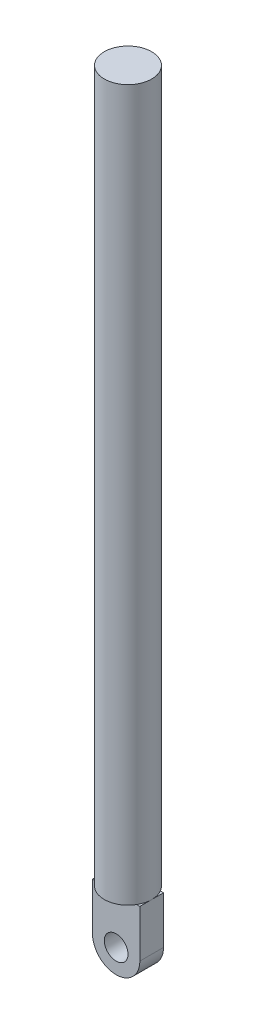
ISO-10303-21;
HEADER;
FILE_DESCRIPTION(('STEP AP214'),'2;1');
FILE_NAME('part.step','',(''),(''),'','','');
FILE_SCHEMA(('AUTOMOTIVE_DESIGN { 1 0 10303 214 1 1 1 1 }'));
ENDSEC;
DATA;
#1=APPLICATION_CONTEXT('core data for automotive mechanical design processes');
#2=APPLICATION_PROTOCOL_DEFINITION('international standard','automotive_design',2000,#1);
#3=PRODUCT_CONTEXT('',#1,'mechanical');
#4=PRODUCT('Part','Part','',(#3));
#5=PRODUCT_RELATED_PRODUCT_CATEGORY('part','',(#4));
#6=PRODUCT_DEFINITION_FORMATION('','',#4);
#7=PRODUCT_DEFINITION_CONTEXT('part definition',#1,'design');
#8=PRODUCT_DEFINITION('design','',#6,#7);
#9=PRODUCT_DEFINITION_SHAPE('','',#8);
#10=(LENGTH_UNIT() NAMED_UNIT(*) SI_UNIT(.MILLI.,.METRE.));
#11=(NAMED_UNIT(*) PLANE_ANGLE_UNIT() SI_UNIT($,.RADIAN.));
#12=(NAMED_UNIT(*) SI_UNIT($,.STERADIAN.) SOLID_ANGLE_UNIT());
#13=UNCERTAINTY_MEASURE_WITH_UNIT(LENGTH_MEASURE(1.E-05),#10,'distance_accuracy_value','');
#14=(GEOMETRIC_REPRESENTATION_CONTEXT(3) GLOBAL_UNCERTAINTY_ASSIGNED_CONTEXT((#13)) GLOBAL_UNIT_ASSIGNED_CONTEXT((#10,
#11,#12)) REPRESENTATION_CONTEXT('',''));
#15=CARTESIAN_POINT('',(0.,0.,0.));
#16=DIRECTION('',(0.,0.,1.));
#17=DIRECTION('',(1.,0.,0.));
#18=AXIS2_PLACEMENT_3D('',#15,#16,#17);
#19=CARTESIAN_POINT('',(0.,190.5,0.));
#20=DIRECTION('',(0.,-1.,0.));
#21=DIRECTION('',(0.,0.,-1.));
#22=AXIS2_PLACEMENT_3D('',#19,#20,#21);
#23=CYLINDRICAL_SURFACE('',#22,12.7);
#24=CARTESIAN_POINT('',(0.,190.5,0.));
#25=DIRECTION('',(0.,1.,0.));
#26=DIRECTION('',(0.,0.,1.));
#27=AXIS2_PLACEMENT_3D('',#24,#25,#26);
#28=CIRCLE('',#27,12.7);
#29=CARTESIAN_POINT('',(0.,190.5,12.7));
#30=VERTEX_POINT('',#29);
#31=EDGE_CURVE('E206',#30,#30,#28,.T.);
#32=ORIENTED_EDGE('',*,*,#31,.F.);
#33=EDGE_LOOP('',(#32));
#34=FACE_BOUND('',#33,.T.);
#35=CARTESIAN_POINT('',(0.,-190.5,0.));
#36=DIRECTION('',(0.,1.,0.));
#37=DIRECTION('',(0.,0.,1.));
#38=AXIS2_PLACEMENT_3D('',#35,#36,#37);
#39=CIRCLE('',#38,12.7);
#40=CARTESIAN_POINT('',(-10.9985226280624,-190.5,6.34999999999998));
#41=VERTEX_POINT('',#40);
#42=CARTESIAN_POINT('',(10.9985226280624,-190.5,6.34999999999998));
#43=VERTEX_POINT('',#42);
#44=EDGE_CURVE('E210',#41,#43,#39,.T.);
#45=ORIENTED_EDGE('',*,*,#44,.T.);
#46=CARTESIAN_POINT('',(12.7,-190.5,0.));
#47=VERTEX_POINT('',#46);
#48=EDGE_CURVE('E188',#43,#47,#39,.T.);
#49=ORIENTED_EDGE('',*,*,#48,.T.);
#50=CARTESIAN_POINT('',(10.9985226280623,-190.5,-6.35000000000002));
#51=VERTEX_POINT('',#50);
#52=EDGE_CURVE('E212',#47,#51,#39,.T.);
#53=ORIENTED_EDGE('',*,*,#52,.T.);
#54=CARTESIAN_POINT('',(-10.9985226280624,-190.5,-6.35000000000002));
#55=VERTEX_POINT('',#54);
#56=EDGE_CURVE('E634',#51,#55,#39,.T.);
#57=ORIENTED_EDGE('',*,*,#56,.T.);
#58=CARTESIAN_POINT('',(-12.7,-190.5,0.));
#59=VERTEX_POINT('',#58);
#60=EDGE_CURVE('E635',#55,#59,#39,.T.);
#61=ORIENTED_EDGE('',*,*,#60,.T.);
#62=EDGE_CURVE('E201',#59,#41,#39,.T.);
#63=ORIENTED_EDGE('',*,*,#62,.T.);
#64=EDGE_LOOP('',(#45,#49,#53,#57,#61,#63));
#65=FACE_BOUND('',#64,.T.);
#66=ADVANCED_FACE('F31',(#34,#65),#23,.T.);
#67=CARTESIAN_POINT('',(0.,190.5,0.));
#68=DIRECTION('',(0.,1.,0.));
#69=DIRECTION('',(0.,0.,1.));
#70=AXIS2_PLACEMENT_3D('',#67,#68,#69);
#71=PLANE('',#70);
#72=ORIENTED_EDGE('',*,*,#31,.T.);
#73=EDGE_LOOP('',(#72));
#74=FACE_BOUND('',#73,.T.);
#75=ADVANCED_FACE('F587',(#74),#71,.T.);
#76=CARTESIAN_POINT('',(-12.7,-190.5,12.7));
#77=DIRECTION('',(0.,1.,0.));
#78=DIRECTION('',(0.,0.,1.));
#79=AXIS2_PLACEMENT_3D('',#76,#77,#78);
#80=PLANE('',#79);
#81=DIRECTION('',(1.,0.,0.));
#82=VECTOR('',#81,1.);
#83=CARTESIAN_POINT('',(-61.0429684205974,-190.5,6.34999999999998));
#84=LINE('',#83,#82);
#85=CARTESIAN_POINT('',(12.7,-190.5,6.34999999999998));
#86=VERTEX_POINT('',#85);
#87=EDGE_CURVE('E173',#43,#86,#84,.T.);
#88=ORIENTED_EDGE('',*,*,#87,.T.);
#89=DIRECTION('',(0.,0.,1.));
#90=VECTOR('',#89,1.);
#91=CARTESIAN_POINT('',(12.7,-190.5,-12.7));
#92=LINE('',#91,#90);
#93=EDGE_CURVE('E187',#47,#86,#92,.T.);
#94=ORIENTED_EDGE('',*,*,#93,.F.);
#95=ORIENTED_EDGE('',*,*,#48,.F.);
#96=EDGE_LOOP('',(#88,#94,#95));
#97=FACE_BOUND('',#96,.T.);
#98=ADVANCED_FACE('F186',(#97),#80,.T.);
#99=DIRECTION('',(1.,0.,0.));
#100=VECTOR('',#99,1.);
#101=CARTESIAN_POINT('',(-61.0429684205974,-190.5,-6.35000000000002));
#102=LINE('',#101,#100);
#103=CARTESIAN_POINT('',(12.7,-190.5,-6.35000000000002));
#104=VERTEX_POINT('',#103);
#105=EDGE_CURVE('E626',#51,#104,#102,.T.);
#106=ORIENTED_EDGE('',*,*,#105,.F.);
#107=ORIENTED_EDGE('',*,*,#52,.F.);
#108=EDGE_CURVE('E197',#104,#47,#92,.T.);
#109=ORIENTED_EDGE('',*,*,#108,.F.);
#110=EDGE_LOOP('',(#106,#107,#109));
#111=FACE_BOUND('',#110,.T.);
#112=ADVANCED_FACE('F570',(#111),#80,.T.);
#113=CARTESIAN_POINT('',(-12.7,-190.5,-6.35000000000002));
#114=VERTEX_POINT('',#113);
#115=EDGE_CURVE('E625',#114,#55,#102,.T.);
#116=ORIENTED_EDGE('',*,*,#115,.F.);
#117=DIRECTION('',(0.,0.,-1.));
#118=VECTOR('',#117,1.);
#119=CARTESIAN_POINT('',(-12.7,-190.5,-12.7));
#120=LINE('',#119,#118);
#121=EDGE_CURVE('E202',#59,#114,#120,.T.);
#122=ORIENTED_EDGE('',*,*,#121,.F.);
#123=ORIENTED_EDGE('',*,*,#60,.F.);
#124=EDGE_LOOP('',(#116,#122,#123));
#125=FACE_BOUND('',#124,.T.);
#126=ADVANCED_FACE('F560',(#125),#80,.T.);
#127=CARTESIAN_POINT('',(-12.7,-190.5,6.34999999999998));
#128=VERTEX_POINT('',#127);
#129=EDGE_CURVE('E192',#128,#41,#84,.T.);
#130=ORIENTED_EDGE('',*,*,#129,.T.);
#131=ORIENTED_EDGE('',*,*,#62,.F.);
#132=EDGE_CURVE('E199',#128,#59,#120,.T.);
#133=ORIENTED_EDGE('',*,*,#132,.F.);
#134=EDGE_LOOP('',(#130,#131,#133));
#135=FACE_BOUND('',#134,.T.);
#136=ADVANCED_FACE('F536',(#135),#80,.T.);
#137=CARTESIAN_POINT('',(-12.7,-228.6,-12.7));
#138=DIRECTION('',(1.,0.,0.));
#139=DIRECTION('',(0.,0.,-1.));
#140=AXIS2_PLACEMENT_3D('',#137,#138,#139);
#141=PLANE('',#140);
#142=DIRECTION('',(0.,1.,0.));
#143=VECTOR('',#142,1.);
#144=CARTESIAN_POINT('',(-12.7,-190.5,-6.35000000000002));
#145=LINE('',#144,#143);
#146=CARTESIAN_POINT('',(-12.7,-215.9,-6.35000000000003));
#147=VERTEX_POINT('',#146);
#148=EDGE_CURVE('E623',#147,#114,#145,.T.);
#149=ORIENTED_EDGE('',*,*,#148,.F.);
#150=DIRECTION('',(0.,0.,-1.));
#151=VECTOR('',#150,1.);
#152=CARTESIAN_POINT('',(-12.7,-215.9,-12.7));
#153=LINE('',#152,#151);
#154=CARTESIAN_POINT('',(-12.7,-215.9,6.34999999999997));
#155=VERTEX_POINT('',#154);
#156=EDGE_CURVE('E219',#147,#155,#153,.F.);
#157=ORIENTED_EDGE('',*,*,#156,.T.);
#158=DIRECTION('',(0.,-1.,0.));
#159=VECTOR('',#158,1.);
#160=CARTESIAN_POINT('',(-12.7,-190.5,6.34999999999998));
#161=LINE('',#160,#159);
#162=EDGE_CURVE('E619',#128,#155,#161,.T.);
#163=ORIENTED_EDGE('',*,*,#162,.F.);
#164=ORIENTED_EDGE('',*,*,#132,.T.);
#165=ORIENTED_EDGE('',*,*,#121,.T.);
#166=EDGE_LOOP('',(#149,#157,#163,#164,#165));
#167=FACE_BOUND('',#166,.T.);
#168=ADVANCED_FACE('F527',(#167),#141,.F.);
#169=CARTESIAN_POINT('',(12.7,-228.6,-12.7));
#170=DIRECTION('',(-1.,0.,0.));
#171=DIRECTION('',(0.,0.,1.));
#172=AXIS2_PLACEMENT_3D('',#169,#170,#171);
#173=PLANE('',#172);
#174=DIRECTION('',(0.,1.,0.));
#175=VECTOR('',#174,1.);
#176=CARTESIAN_POINT('',(12.7,-190.5,6.34999999999998));
#177=LINE('',#176,#175);
#178=CARTESIAN_POINT('',(12.7,-215.9,6.34999999999997));
#179=VERTEX_POINT('',#178);
#180=EDGE_CURVE('E169',#179,#86,#177,.T.);
#181=ORIENTED_EDGE('',*,*,#180,.F.);
#182=DIRECTION('',(0.,0.,1.));
#183=VECTOR('',#182,1.);
#184=CARTESIAN_POINT('',(12.7,-215.9,-12.7));
#185=LINE('',#184,#183);
#186=CARTESIAN_POINT('',(12.7,-215.9,-6.35000000000003));
#187=VERTEX_POINT('',#186);
#188=EDGE_CURVE('E215',#179,#187,#185,.F.);
#189=ORIENTED_EDGE('',*,*,#188,.T.);
#190=DIRECTION('',(0.,-1.,0.));
#191=VECTOR('',#190,1.);
#192=CARTESIAN_POINT('',(12.7,-190.5,-6.35000000000002));
#193=LINE('',#192,#191);
#194=EDGE_CURVE('E620',#104,#187,#193,.T.);
#195=ORIENTED_EDGE('',*,*,#194,.F.);
#196=ORIENTED_EDGE('',*,*,#108,.T.);
#197=ORIENTED_EDGE('',*,*,#93,.T.);
#198=EDGE_LOOP('',(#181,#189,#195,#196,#197));
#199=FACE_BOUND('',#198,.T.);
#200=ADVANCED_FACE('F194',(#199),#173,.F.);
#201=CARTESIAN_POINT('',(-61.0429684205974,-190.5,-6.35000000000002));
#202=DIRECTION('',(0.,1.,0.));
#203=DIRECTION('',(0.,0.,1.));
#204=AXIS2_PLACEMENT_3D('',#201,#202,#203);
#205=PLANE('',#204);
#206=EDGE_CURVE('E628',#55,#51,#102,.T.);
#207=ORIENTED_EDGE('',*,*,#206,.F.);
#208=ORIENTED_EDGE('',*,*,#56,.F.);
#209=EDGE_LOOP('',(#207,#208));
#210=FACE_BOUND('',#209,.T.);
#211=ADVANCED_FACE('F503',(#210),#205,.F.);
#212=CARTESIAN_POINT('',(-61.0429684205974,-190.5,-6.35000000000002));
#213=DIRECTION('',(0.,0.,1.));
#214=DIRECTION('',(0.,-1.,0.));
#215=AXIS2_PLACEMENT_3D('',#212,#213,#214);
#216=PLANE('',#215);
#217=CARTESIAN_POINT('',(0.,-215.9,-6.35000000000003));
#218=DIRECTION('',(0.,0.,1.));
#219=DIRECTION('',(0.,-1.,0.));
#220=AXIS2_PLACEMENT_3D('',#217,#218,#219);
#221=CIRCLE('',#220,6.35);
#222=CARTESIAN_POINT('',(0.,-222.25,-6.35000000000003));
#223=VERTEX_POINT('',#222);
#224=EDGE_CURVE('E222',#223,#223,#221,.F.);
#225=ORIENTED_EDGE('',*,*,#224,.F.);
#226=EDGE_LOOP('',(#225));
#227=FACE_BOUND('',#226,.T.);
#228=ORIENTED_EDGE('',*,*,#194,.T.);
#229=CARTESIAN_POINT('',(0.,-215.9,-6.35000000000003));
#230=DIRECTION('',(0.,0.,1.));
#231=DIRECTION('',(0.,-1.,0.));
#232=AXIS2_PLACEMENT_3D('',#229,#230,#231);
#233=CIRCLE('',#232,12.7);
#234=CARTESIAN_POINT('',(0.,-228.6,-6.35000000000003));
#235=VERTEX_POINT('',#234);
#236=EDGE_CURVE('E122',#187,#235,#233,.F.);
#237=ORIENTED_EDGE('',*,*,#236,.T.);
#238=CARTESIAN_POINT('',(0.,-215.9,-6.35000000000003));
#239=DIRECTION('',(0.,0.,1.));
#240=DIRECTION('',(0.,-1.,0.));
#241=AXIS2_PLACEMENT_3D('',#238,#239,#240);
#242=CIRCLE('',#241,12.7);
#243=EDGE_CURVE('E126',#235,#147,#242,.F.);
#244=ORIENTED_EDGE('',*,*,#243,.T.);
#245=ORIENTED_EDGE('',*,*,#148,.T.);
#246=ORIENTED_EDGE('',*,*,#115,.T.);
#247=ORIENTED_EDGE('',*,*,#206,.T.);
#248=ORIENTED_EDGE('',*,*,#105,.T.);
#249=EDGE_LOOP('',(#228,#237,#244,#245,#246,#247,#248));
#250=FACE_BOUND('',#249,.T.);
#251=ADVANCED_FACE('F498',(#227,#250),#216,.F.);
#252=CARTESIAN_POINT('',(-61.0429684205974,-190.5,6.34999999999998));
#253=DIRECTION('',(0.,1.,0.));
#254=DIRECTION('',(0.,0.,1.));
#255=AXIS2_PLACEMENT_3D('',#252,#253,#254);
#256=PLANE('',#255);
#257=ORIENTED_EDGE('',*,*,#44,.F.);
#258=EDGE_CURVE('E190',#41,#43,#84,.T.);
#259=ORIENTED_EDGE('',*,*,#258,.T.);
#260=EDGE_LOOP('',(#257,#259));
#261=FACE_BOUND('',#260,.T.);
#262=ADVANCED_FACE('F488',(#261),#256,.F.);
#263=CARTESIAN_POINT('',(-61.0429684205974,-190.5,6.34999999999998));
#264=DIRECTION('',(0.,0.,-1.));
#265=DIRECTION('',(0.,1.,0.));
#266=AXIS2_PLACEMENT_3D('',#263,#264,#265);
#267=PLANE('',#266);
#268=CARTESIAN_POINT('',(0.,-215.9,6.35));
#269=DIRECTION('',(0.,0.,1.));
#270=DIRECTION('',(1.,0.,0.));
#271=AXIS2_PLACEMENT_3D('',#268,#269,#270);
#272=CIRCLE('',#271,6.35);
#273=CARTESIAN_POINT('',(6.35,-215.9,6.35));
#274=VERTEX_POINT('',#273);
#275=EDGE_CURVE('E643',#274,#274,#272,.T.);
#276=ORIENTED_EDGE('',*,*,#275,.F.);
#277=EDGE_LOOP('',(#276));
#278=FACE_BOUND('',#277,.T.);
#279=CARTESIAN_POINT('',(0.,-215.9,6.34999999999997));
#280=DIRECTION('',(0.,0.,-1.));
#281=DIRECTION('',(0.,1.,0.));
#282=AXIS2_PLACEMENT_3D('',#279,#280,#281);
#283=CIRCLE('',#282,12.7);
#284=CARTESIAN_POINT('',(0.,-228.6,6.34999999999997));
#285=VERTEX_POINT('',#284);
#286=EDGE_CURVE('E209',#155,#285,#283,.F.);
#287=ORIENTED_EDGE('',*,*,#286,.T.);
#288=CARTESIAN_POINT('',(0.,-215.9,6.34999999999997));
#289=DIRECTION('',(0.,0.,-1.));
#290=DIRECTION('',(0.,1.,0.));
#291=AXIS2_PLACEMENT_3D('',#288,#289,#290);
#292=CIRCLE('',#291,12.7);
#293=EDGE_CURVE('E176',#285,#179,#292,.F.);
#294=ORIENTED_EDGE('',*,*,#293,.T.);
#295=ORIENTED_EDGE('',*,*,#180,.T.);
#296=ORIENTED_EDGE('',*,*,#87,.F.);
#297=ORIENTED_EDGE('',*,*,#258,.F.);
#298=ORIENTED_EDGE('',*,*,#129,.F.);
#299=ORIENTED_EDGE('',*,*,#162,.T.);
#300=EDGE_LOOP('',(#287,#294,#295,#296,#297,#298,#299));
#301=FACE_BOUND('',#300,.T.);
#302=ADVANCED_FACE('F171',(#278,#301),#267,.F.);
#303=CARTESIAN_POINT('',(0.,-215.9,12.7));
#304=DIRECTION('',(0.,0.,-1.));
#305=DIRECTION('',(-1.,0.,0.));
#306=AXIS2_PLACEMENT_3D('',#303,#304,#305);
#307=CYLINDRICAL_SURFACE('',#306,12.7);
#308=ORIENTED_EDGE('',*,*,#156,.F.);
#309=ORIENTED_EDGE('',*,*,#243,.F.);
#310=DIRECTION('',(0.,0.,-1.));
#311=VECTOR('',#310,1.);
#312=CARTESIAN_POINT('',(0.,-228.6,12.7));
#313=LINE('',#312,#311);
#314=EDGE_CURVE('E181',#285,#235,#313,.T.);
#315=ORIENTED_EDGE('',*,*,#314,.F.);
#316=ORIENTED_EDGE('',*,*,#286,.F.);
#317=EDGE_LOOP('',(#308,#309,#315,#316));
#318=FACE_BOUND('',#317,.T.);
#319=ADVANCED_FACE('F345',(#318),#307,.T.);
#320=CARTESIAN_POINT('',(0.,-215.9,12.7));
#321=DIRECTION('',(0.,0.,1.));
#322=DIRECTION('',(1.,0.,0.));
#323=AXIS2_PLACEMENT_3D('',#320,#321,#322);
#324=CYLINDRICAL_SURFACE('',#323,12.7);
#325=ORIENTED_EDGE('',*,*,#236,.F.);
#326=ORIENTED_EDGE('',*,*,#188,.F.);
#327=ORIENTED_EDGE('',*,*,#293,.F.);
#328=ORIENTED_EDGE('',*,*,#314,.T.);
#329=EDGE_LOOP('',(#325,#326,#327,#328));
#330=FACE_BOUND('',#329,.T.);
#331=ADVANCED_FACE('F476',(#330),#324,.T.);
#332=CARTESIAN_POINT('',(0.,-215.9,-24.3105122421383));
#333=DIRECTION('',(0.,0.,1.));
#334=DIRECTION('',(1.,0.,0.));
#335=AXIS2_PLACEMENT_3D('',#332,#333,#334);
#336=CYLINDRICAL_SURFACE('',#335,6.35);
#337=ORIENTED_EDGE('',*,*,#224,.T.);
#338=EDGE_LOOP('',(#337));
#339=FACE_BOUND('',#338,.T.);
#340=ORIENTED_EDGE('',*,*,#275,.T.);
#341=EDGE_LOOP('',(#340));
#342=FACE_BOUND('',#341,.T.);
#343=ADVANCED_FACE('F473',(#339,#342),#336,.F.);
#344=CLOSED_SHELL('',(#66,#75,#98,#112,#126,#136,#168,#200,#211,#251,#262,#302,#319,#331,#343));
#345=CARTESIAN_POINT('',(0.,190.5,0.));
#346=DIRECTION('',(0.,-1.,0.));
#347=DIRECTION('',(0.,0.,-1.));
#348=AXIS2_PLACEMENT_3D('',#345,#346,#347);
#349=CYLINDRICAL_SURFACE('',#348,10.16);
#350=CARTESIAN_POINT('',(0.,187.96,0.));
#351=DIRECTION('',(0.,1.,0.));
#352=DIRECTION('',(0.,0.,1.));
#353=AXIS2_PLACEMENT_3D('',#350,#351,#352);
#354=CIRCLE('',#353,10.16);
#355=CARTESIAN_POINT('',(0.,187.96,10.16));
#356=VERTEX_POINT('',#355);
#357=EDGE_CURVE('E279',#356,#356,#354,.T.);
#358=ORIENTED_EDGE('',*,*,#357,.T.);
#359=EDGE_LOOP('',(#358));
#360=FACE_BOUND('',#359,.T.);
#361=CARTESIAN_POINT('',(0.,-187.96,0.));
#362=DIRECTION('',(0.,1.,0.));
#363=DIRECTION('',(0.,0.,1.));
#364=AXIS2_PLACEMENT_3D('',#361,#362,#363);
#365=CIRCLE('',#364,10.16);
#366=CARTESIAN_POINT('',(-9.4185720786115,-187.96,3.80999999999998));
#367=VERTEX_POINT('',#366);
#368=CARTESIAN_POINT('',(9.4185720786115,-187.96,3.80999999999998));
#369=VERTEX_POINT('',#368);
#370=EDGE_CURVE('E35',#367,#369,#365,.T.);
#371=ORIENTED_EDGE('',*,*,#370,.F.);
#372=DIRECTION('',(0.,-1.,0.));
#373=VECTOR('',#372,1.);
#374=CARTESIAN_POINT('',(-9.4185720786115,-193.04,3.80999999999998));
#375=LINE('',#374,#373);
#376=CARTESIAN_POINT('',(-9.4185720786115,-193.04,3.80999999999998));
#377=VERTEX_POINT('',#376);
#378=EDGE_CURVE('E282',#377,#367,#375,.F.);
#379=ORIENTED_EDGE('',*,*,#378,.F.);
#380=CARTESIAN_POINT('',(0.,-193.04,0.));
#381=DIRECTION('',(0.,1.,0.));
#382=DIRECTION('',(0.,0.,1.));
#383=AXIS2_PLACEMENT_3D('',#380,#381,#382);
#384=CIRCLE('',#383,10.16);
#385=CARTESIAN_POINT('',(-10.16,-193.04,0.));
#386=VERTEX_POINT('',#385);
#387=EDGE_CURVE('E285',#386,#377,#384,.T.);
#388=ORIENTED_EDGE('',*,*,#387,.F.);
#389=CARTESIAN_POINT('',(0.,-193.04,0.));
#390=DIRECTION('',(0.,1.,0.));
#391=DIRECTION('',(0.,0.,1.));
#392=AXIS2_PLACEMENT_3D('',#389,#390,#391);
#393=CIRCLE('',#392,10.16);
#394=CARTESIAN_POINT('',(-9.41857207861148,-193.04,-3.81000000000002));
#395=VERTEX_POINT('',#394);
#396=EDGE_CURVE('E288',#395,#386,#393,.T.);
#397=ORIENTED_EDGE('',*,*,#396,.F.);
#398=DIRECTION('',(0.,-1.,0.));
#399=VECTOR('',#398,1.);
#400=CARTESIAN_POINT('',(-9.41857207861148,-193.04,-3.81000000000002));
#401=LINE('',#400,#399);
#402=CARTESIAN_POINT('',(-9.41857207861148,-187.96,-3.81000000000002));
#403=VERTEX_POINT('',#402);
#404=EDGE_CURVE('E245',#395,#403,#401,.F.);
#405=ORIENTED_EDGE('',*,*,#404,.T.);
#406=CARTESIAN_POINT('',(0.,-187.96,0.));
#407=DIRECTION('',(0.,1.,0.));
#408=DIRECTION('',(0.,0.,1.));
#409=AXIS2_PLACEMENT_3D('',#406,#407,#408);
#410=CIRCLE('',#409,10.16);
#411=CARTESIAN_POINT('',(9.41857207861148,-187.96,-3.81000000000002));
#412=VERTEX_POINT('',#411);
#413=EDGE_CURVE('E291',#412,#403,#410,.T.);
#414=ORIENTED_EDGE('',*,*,#413,.F.);
#415=DIRECTION('',(0.,-1.,0.));
#416=VECTOR('',#415,1.);
#417=CARTESIAN_POINT('',(9.41857207861148,-193.04,-3.81000000000002));
#418=LINE('',#417,#416);
#419=CARTESIAN_POINT('',(9.41857207861148,-193.04,-3.81000000000002));
#420=VERTEX_POINT('',#419);
#421=EDGE_CURVE('E293',#420,#412,#418,.F.);
#422=ORIENTED_EDGE('',*,*,#421,.F.);
#423=CARTESIAN_POINT('',(0.,-193.04,0.));
#424=DIRECTION('',(0.,1.,0.));
#425=DIRECTION('',(0.,0.,1.));
#426=AXIS2_PLACEMENT_3D('',#423,#424,#425);
#427=CIRCLE('',#426,10.16);
#428=CARTESIAN_POINT('',(10.16,-193.04,0.));
#429=VERTEX_POINT('',#428);
#430=EDGE_CURVE('E296',#429,#420,#427,.T.);
#431=ORIENTED_EDGE('',*,*,#430,.F.);
#432=CARTESIAN_POINT('',(0.,-193.04,0.));
#433=DIRECTION('',(0.,1.,0.));
#434=DIRECTION('',(0.,0.,1.));
#435=AXIS2_PLACEMENT_3D('',#432,#433,#434);
#436=CIRCLE('',#435,10.16);
#437=CARTESIAN_POINT('',(9.4185720786115,-193.04,3.80999999999998));
#438=VERTEX_POINT('',#437);
#439=EDGE_CURVE('E298',#438,#429,#436,.T.);
#440=ORIENTED_EDGE('',*,*,#439,.F.);
#441=DIRECTION('',(0.,-1.,0.));
#442=VECTOR('',#441,1.);
#443=CARTESIAN_POINT('',(9.4185720786115,-193.04,3.80999999999998));
#444=LINE('',#443,#442);
#445=EDGE_CURVE('E111',#438,#369,#444,.F.);
#446=ORIENTED_EDGE('',*,*,#445,.T.);
#447=EDGE_LOOP('',(#371,#379,#388,#397,#405,#414,#422,#431,#440,#446));
#448=FACE_BOUND('',#447,.T.);
#449=ADVANCED_FACE('F310',(#360,#448),#349,.F.);
#450=CARTESIAN_POINT('',(0.,187.96,0.));
#451=DIRECTION('',(0.,1.,0.));
#452=DIRECTION('',(0.,0.,1.));
#453=AXIS2_PLACEMENT_3D('',#450,#451,#452);
#454=PLANE('',#453);
#455=ORIENTED_EDGE('',*,*,#357,.F.);
#456=EDGE_LOOP('',(#455));
#457=FACE_BOUND('',#456,.T.);
#458=ADVANCED_FACE('F335',(#457),#454,.F.);
#459=CARTESIAN_POINT('',(-12.7,-193.04,12.7));
#460=DIRECTION('',(0.,1.,0.));
#461=DIRECTION('',(0.,0.,1.));
#462=AXIS2_PLACEMENT_3D('',#459,#460,#461);
#463=PLANE('',#462);
#464=DIRECTION('',(1.,0.,0.));
#465=VECTOR('',#464,1.);
#466=CARTESIAN_POINT('',(-61.0429684205974,-193.04,3.80999999999998));
#467=LINE('',#466,#465);
#468=CARTESIAN_POINT('',(10.16,-193.04,3.80999999999998));
#469=VERTEX_POINT('',#468);
#470=EDGE_CURVE('E277',#438,#469,#467,.T.);
#471=ORIENTED_EDGE('',*,*,#470,.F.);
#472=ORIENTED_EDGE('',*,*,#439,.T.);
#473=DIRECTION('',(0.,0.,1.));
#474=VECTOR('',#473,1.);
#475=CARTESIAN_POINT('',(10.16,-193.04,12.7));
#476=LINE('',#475,#474);
#477=EDGE_CURVE('E259',#429,#469,#476,.T.);
#478=ORIENTED_EDGE('',*,*,#477,.T.);
#479=EDGE_LOOP('',(#471,#472,#478));
#480=FACE_BOUND('',#479,.T.);
#481=ADVANCED_FACE('F301',(#480),#463,.F.);
#482=DIRECTION('',(1.,0.,0.));
#483=VECTOR('',#482,1.);
#484=CARTESIAN_POINT('',(-12.7,-193.04,-3.81000000000002));
#485=LINE('',#484,#483);
#486=CARTESIAN_POINT('',(10.16,-193.04,-3.81000000000002));
#487=VERTEX_POINT('',#486);
#488=EDGE_CURVE('E241',#420,#487,#485,.T.);
#489=ORIENTED_EDGE('',*,*,#488,.T.);
#490=DIRECTION('',(0.,0.,1.));
#491=VECTOR('',#490,1.);
#492=CARTESIAN_POINT('',(10.16,-193.04,12.7));
#493=LINE('',#492,#491);
#494=EDGE_CURVE('E262',#487,#429,#493,.T.);
#495=ORIENTED_EDGE('',*,*,#494,.T.);
#496=ORIENTED_EDGE('',*,*,#430,.T.);
#497=EDGE_LOOP('',(#489,#495,#496));
#498=FACE_BOUND('',#497,.T.);
#499=ADVANCED_FACE('F307',(#498),#463,.F.);
#500=DIRECTION('',(1.,0.,0.));
#501=VECTOR('',#500,1.);
#502=CARTESIAN_POINT('',(-12.7,-193.04,-3.81000000000002));
#503=LINE('',#502,#501);
#504=CARTESIAN_POINT('',(-10.16,-193.04,-3.81000000000002));
#505=VERTEX_POINT('',#504);
#506=EDGE_CURVE('E248',#505,#395,#503,.T.);
#507=ORIENTED_EDGE('',*,*,#506,.T.);
#508=ORIENTED_EDGE('',*,*,#396,.T.);
#509=DIRECTION('',(0.,0.,-1.));
#510=VECTOR('',#509,1.);
#511=CARTESIAN_POINT('',(-10.16,-193.04,12.7));
#512=LINE('',#511,#510);
#513=EDGE_CURVE('E267',#386,#505,#512,.T.);
#514=ORIENTED_EDGE('',*,*,#513,.T.);
#515=EDGE_LOOP('',(#507,#508,#514));
#516=FACE_BOUND('',#515,.T.);
#517=ADVANCED_FACE('F372',(#516),#463,.F.);
#518=DIRECTION('',(1.,0.,0.));
#519=VECTOR('',#518,1.);
#520=CARTESIAN_POINT('',(-61.0429684205974,-193.04,3.80999999999998));
#521=LINE('',#520,#519);
#522=CARTESIAN_POINT('',(-10.16,-193.04,3.80999999999998));
#523=VERTEX_POINT('',#522);
#524=EDGE_CURVE('E274',#523,#377,#521,.T.);
#525=ORIENTED_EDGE('',*,*,#524,.F.);
#526=DIRECTION('',(0.,0.,-1.));
#527=VECTOR('',#526,1.);
#528=CARTESIAN_POINT('',(-10.16,-193.04,12.7));
#529=LINE('',#528,#527);
#530=EDGE_CURVE('E270',#523,#386,#529,.T.);
#531=ORIENTED_EDGE('',*,*,#530,.T.);
#532=ORIENTED_EDGE('',*,*,#387,.T.);
#533=EDGE_LOOP('',(#525,#531,#532));
#534=FACE_BOUND('',#533,.T.);
#535=ADVANCED_FACE('F350',(#534),#463,.F.);
#536=CARTESIAN_POINT('',(-10.16,-228.6,-12.7));
#537=DIRECTION('',(1.,0.,0.));
#538=DIRECTION('',(0.,0.,-1.));
#539=AXIS2_PLACEMENT_3D('',#536,#537,#538);
#540=PLANE('',#539);
#541=DIRECTION('',(0.,1.,0.));
#542=VECTOR('',#541,1.);
#543=CARTESIAN_POINT('',(-10.16,-190.5,-3.81000000000002));
#544=LINE('',#543,#542);
#545=CARTESIAN_POINT('',(-10.16,-215.9,-3.81000000000003));
#546=VERTEX_POINT('',#545);
#547=EDGE_CURVE('E251',#546,#505,#544,.T.);
#548=ORIENTED_EDGE('',*,*,#547,.T.);
#549=ORIENTED_EDGE('',*,*,#513,.F.);
#550=ORIENTED_EDGE('',*,*,#530,.F.);
#551=DIRECTION('',(0.,-1.,0.));
#552=VECTOR('',#551,1.);
#553=CARTESIAN_POINT('',(-10.16,-190.5,3.80999999999998));
#554=LINE('',#553,#552);
#555=CARTESIAN_POINT('',(-10.16,-215.9,3.80999999999997));
#556=VERTEX_POINT('',#555);
#557=EDGE_CURVE('E229',#523,#556,#554,.T.);
#558=ORIENTED_EDGE('',*,*,#557,.T.);
#559=DIRECTION('',(0.,0.,-1.));
#560=VECTOR('',#559,1.);
#561=CARTESIAN_POINT('',(-10.16,-215.9,-12.7));
#562=LINE('',#561,#560);
#563=EDGE_CURVE('E272',#546,#556,#562,.F.);
#564=ORIENTED_EDGE('',*,*,#563,.F.);
#565=EDGE_LOOP('',(#548,#549,#550,#558,#564));
#566=FACE_BOUND('',#565,.T.);
#567=ADVANCED_FACE('F351',(#566),#540,.T.);
#568=CARTESIAN_POINT('',(10.16,-228.6,-12.7));
#569=DIRECTION('',(-1.,0.,0.));
#570=DIRECTION('',(0.,0.,1.));
#571=AXIS2_PLACEMENT_3D('',#568,#569,#570);
#572=PLANE('',#571);
#573=DIRECTION('',(0.,1.,0.));
#574=VECTOR('',#573,1.);
#575=CARTESIAN_POINT('',(10.16,-190.5,3.80999999999998));
#576=LINE('',#575,#574);
#577=CARTESIAN_POINT('',(10.16,-215.9,3.80999999999997));
#578=VERTEX_POINT('',#577);
#579=EDGE_CURVE('E233',#578,#469,#576,.T.);
#580=ORIENTED_EDGE('',*,*,#579,.T.);
#581=ORIENTED_EDGE('',*,*,#477,.F.);
#582=ORIENTED_EDGE('',*,*,#494,.F.);
#583=DIRECTION('',(0.,-1.,0.));
#584=VECTOR('',#583,1.);
#585=CARTESIAN_POINT('',(10.16,-190.5,-3.81000000000002));
#586=LINE('',#585,#584);
#587=CARTESIAN_POINT('',(10.16,-215.9,-3.81000000000003));
#588=VERTEX_POINT('',#587);
#589=EDGE_CURVE('E256',#487,#588,#586,.T.);
#590=ORIENTED_EDGE('',*,*,#589,.T.);
#591=DIRECTION('',(0.,0.,1.));
#592=VECTOR('',#591,1.);
#593=CARTESIAN_POINT('',(10.16,-215.9,-12.7));
#594=LINE('',#593,#592);
#595=EDGE_CURVE('E265',#578,#588,#594,.F.);
#596=ORIENTED_EDGE('',*,*,#595,.F.);
#597=EDGE_LOOP('',(#580,#581,#582,#590,#596));
#598=FACE_BOUND('',#597,.T.);
#599=ADVANCED_FACE('F312',(#598),#572,.T.);
#600=CARTESIAN_POINT('',(-61.0429684205974,-187.96,-6.35000000000002));
#601=DIRECTION('',(0.,1.,0.));
#602=DIRECTION('',(0.,0.,1.));
#603=AXIS2_PLACEMENT_3D('',#600,#601,#602);
#604=PLANE('',#603);
#605=DIRECTION('',(1.,0.,0.));
#606=VECTOR('',#605,1.);
#607=CARTESIAN_POINT('',(-61.0429684205974,-187.96,-3.81000000000002));
#608=LINE('',#607,#606);
#609=EDGE_CURVE('E243',#403,#412,#608,.T.);
#610=ORIENTED_EDGE('',*,*,#609,.T.);
#611=ORIENTED_EDGE('',*,*,#413,.T.);
#612=EDGE_LOOP('',(#610,#611));
#613=FACE_BOUND('',#612,.T.);
#614=ADVANCED_FACE('F357',(#613),#604,.T.);
#615=CARTESIAN_POINT('',(-61.0429684205974,-190.5,-3.81000000000002));
#616=DIRECTION('',(0.,0.,1.));
#617=DIRECTION('',(0.,-1.,0.));
#618=AXIS2_PLACEMENT_3D('',#615,#616,#617);
#619=PLANE('',#618);
#620=CARTESIAN_POINT('',(0.,-215.9,-3.81000000000003));
#621=DIRECTION('',(0.,0.,1.));
#622=DIRECTION('',(0.,-1.,0.));
#623=AXIS2_PLACEMENT_3D('',#620,#621,#622);
#624=CIRCLE('',#623,8.89);
#625=CARTESIAN_POINT('',(0.,-224.79,-3.81000000000003));
#626=VERTEX_POINT('',#625);
#627=EDGE_CURVE('E42',#626,#626,#624,.F.);
#628=ORIENTED_EDGE('',*,*,#627,.T.);
#629=EDGE_LOOP('',(#628));
#630=FACE_BOUND('',#629,.T.);
#631=ORIENTED_EDGE('',*,*,#589,.F.);
#632=ORIENTED_EDGE('',*,*,#488,.F.);
#633=ORIENTED_EDGE('',*,*,#421,.T.);
#634=ORIENTED_EDGE('',*,*,#609,.F.);
#635=ORIENTED_EDGE('',*,*,#404,.F.);
#636=ORIENTED_EDGE('',*,*,#506,.F.);
#637=ORIENTED_EDGE('',*,*,#547,.F.);
#638=CARTESIAN_POINT('',(0.,-215.9,-3.81000000000003));
#639=DIRECTION('',(0.,0.,1.));
#640=DIRECTION('',(0.,-1.,0.));
#641=AXIS2_PLACEMENT_3D('',#638,#639,#640);
#642=CIRCLE('',#641,10.16);
#643=CARTESIAN_POINT('',(0.,-226.06,-3.81000000000003));
#644=VERTEX_POINT('',#643);
#645=EDGE_CURVE('E253',#644,#546,#642,.F.);
#646=ORIENTED_EDGE('',*,*,#645,.F.);
#647=CARTESIAN_POINT('',(0.,-215.9,-3.81000000000003));
#648=DIRECTION('',(0.,0.,1.));
#649=DIRECTION('',(0.,-1.,0.));
#650=AXIS2_PLACEMENT_3D('',#647,#648,#649);
#651=CIRCLE('',#650,10.16);
#652=EDGE_CURVE('E51',#588,#644,#651,.F.);
#653=ORIENTED_EDGE('',*,*,#652,.F.);
#654=EDGE_LOOP('',(#631,#632,#633,#634,#635,#636,#637,#646,#653));
#655=FACE_BOUND('',#654,.T.);
#656=ADVANCED_FACE('F332',(#630,#655),#619,.T.);
#657=CARTESIAN_POINT('',(-61.0429684205974,-187.96,6.34999999999998));
#658=DIRECTION('',(0.,1.,0.));
#659=DIRECTION('',(0.,0.,1.));
#660=AXIS2_PLACEMENT_3D('',#657,#658,#659);
#661=PLANE('',#660);
#662=ORIENTED_EDGE('',*,*,#370,.T.);
#663=DIRECTION('',(1.,0.,0.));
#664=VECTOR('',#663,1.);
#665=CARTESIAN_POINT('',(-61.0429684205974,-187.96,3.80999999999998));
#666=LINE('',#665,#664);
#667=EDGE_CURVE('E239',#367,#369,#666,.T.);
#668=ORIENTED_EDGE('',*,*,#667,.F.);
#669=EDGE_LOOP('',(#662,#668));
#670=FACE_BOUND('',#669,.T.);
#671=ADVANCED_FACE('F321',(#670),#661,.T.);
#672=CARTESIAN_POINT('',(-61.0429684205974,-190.5,3.80999999999998));
#673=DIRECTION('',(0.,0.,-1.));
#674=DIRECTION('',(0.,1.,0.));
#675=AXIS2_PLACEMENT_3D('',#672,#673,#674);
#676=PLANE('',#675);
#677=CARTESIAN_POINT('',(0.,-215.9,3.80999999999997));
#678=DIRECTION('',(0.,0.,-1.));
#679=DIRECTION('',(0.,1.,0.));
#680=AXIS2_PLACEMENT_3D('',#677,#678,#679);
#681=CIRCLE('',#680,8.89);
#682=CARTESIAN_POINT('',(0.,-207.01,3.80999999999997));
#683=VERTEX_POINT('',#682);
#684=EDGE_CURVE('E11',#683,#683,#681,.F.);
#685=ORIENTED_EDGE('',*,*,#684,.T.);
#686=EDGE_LOOP('',(#685));
#687=FACE_BOUND('',#686,.T.);
#688=CARTESIAN_POINT('',(0.,-215.9,3.80999999999997));
#689=DIRECTION('',(0.,0.,-1.));
#690=DIRECTION('',(0.,1.,0.));
#691=AXIS2_PLACEMENT_3D('',#688,#689,#690);
#692=CIRCLE('',#691,10.16);
#693=CARTESIAN_POINT('',(0.,-226.06,3.80999999999997));
#694=VERTEX_POINT('',#693);
#695=EDGE_CURVE('E237',#556,#694,#692,.F.);
#696=ORIENTED_EDGE('',*,*,#695,.F.);
#697=ORIENTED_EDGE('',*,*,#557,.F.);
#698=ORIENTED_EDGE('',*,*,#524,.T.);
#699=ORIENTED_EDGE('',*,*,#378,.T.);
#700=ORIENTED_EDGE('',*,*,#667,.T.);
#701=ORIENTED_EDGE('',*,*,#445,.F.);
#702=ORIENTED_EDGE('',*,*,#470,.T.);
#703=ORIENTED_EDGE('',*,*,#579,.F.);
#704=CARTESIAN_POINT('',(0.,-215.9,3.80999999999997));
#705=DIRECTION('',(0.,0.,-1.));
#706=DIRECTION('',(0.,1.,0.));
#707=AXIS2_PLACEMENT_3D('',#704,#705,#706);
#708=CIRCLE('',#707,10.16);
#709=EDGE_CURVE('E235',#694,#578,#708,.F.);
#710=ORIENTED_EDGE('',*,*,#709,.F.);
#711=EDGE_LOOP('',(#696,#697,#698,#699,#700,#701,#702,#703,#710));
#712=FACE_BOUND('',#711,.T.);
#713=ADVANCED_FACE('F317',(#687,#712),#676,.T.);
#714=CARTESIAN_POINT('',(0.,-215.9,12.7));
#715=DIRECTION('',(0.,0.,-1.));
#716=DIRECTION('',(-1.,0.,0.));
#717=AXIS2_PLACEMENT_3D('',#714,#715,#716);
#718=CYLINDRICAL_SURFACE('',#717,10.16);
#719=ORIENTED_EDGE('',*,*,#563,.T.);
#720=ORIENTED_EDGE('',*,*,#695,.T.);
#721=DIRECTION('',(0.,0.,1.));
#722=VECTOR('',#721,1.);
#723=CARTESIAN_POINT('',(0.,-226.06,12.7));
#724=LINE('',#723,#722);
#725=EDGE_CURVE('E226',#694,#644,#724,.F.);
#726=ORIENTED_EDGE('',*,*,#725,.T.);
#727=ORIENTED_EDGE('',*,*,#645,.T.);
#728=EDGE_LOOP('',(#719,#720,#726,#727));
#729=FACE_BOUND('',#728,.T.);
#730=ADVANCED_FACE('F320',(#729),#718,.F.);
#731=CARTESIAN_POINT('',(0.,-215.9,12.7));
#732=DIRECTION('',(0.,0.,1.));
#733=DIRECTION('',(1.,0.,0.));
#734=AXIS2_PLACEMENT_3D('',#731,#732,#733);
#735=CYLINDRICAL_SURFACE('',#734,10.16);
#736=ORIENTED_EDGE('',*,*,#652,.T.);
#737=ORIENTED_EDGE('',*,*,#725,.F.);
#738=ORIENTED_EDGE('',*,*,#709,.T.);
#739=ORIENTED_EDGE('',*,*,#595,.T.);
#740=EDGE_LOOP('',(#736,#737,#738,#739));
#741=FACE_BOUND('',#740,.T.);
#742=ADVANCED_FACE('F329',(#741),#735,.F.);
#743=CARTESIAN_POINT('',(0.,-215.9,-24.3105122421383));
#744=DIRECTION('',(0.,0.,1.));
#745=DIRECTION('',(1.,0.,0.));
#746=AXIS2_PLACEMENT_3D('',#743,#744,#745);
#747=CYLINDRICAL_SURFACE('',#746,8.89);
#748=ORIENTED_EDGE('',*,*,#627,.F.);
#749=EDGE_LOOP('',(#748));
#750=FACE_BOUND('',#749,.T.);
#751=ORIENTED_EDGE('',*,*,#684,.F.);
#752=EDGE_LOOP('',(#751));
#753=FACE_BOUND('',#752,.T.);
#754=ADVANCED_FACE('F33',(#750,#753),#747,.T.);
#755=CLOSED_SHELL('',(#449,#458,#481,#499,#517,#535,#567,#599,#614,#656,#671,#713,#730,#742,#754));
#756=ORIENTED_CLOSED_SHELL('',*,#755,.T.);
#757=BREP_WITH_VOIDS('B2',#344,(#756));
#758=ADVANCED_BREP_SHAPE_REPRESENTATION('',(#18,#757),#14);
#759=SHAPE_DEFINITION_REPRESENTATION(#9,#758);
ENDSEC;
END-ISO-10303-21;
